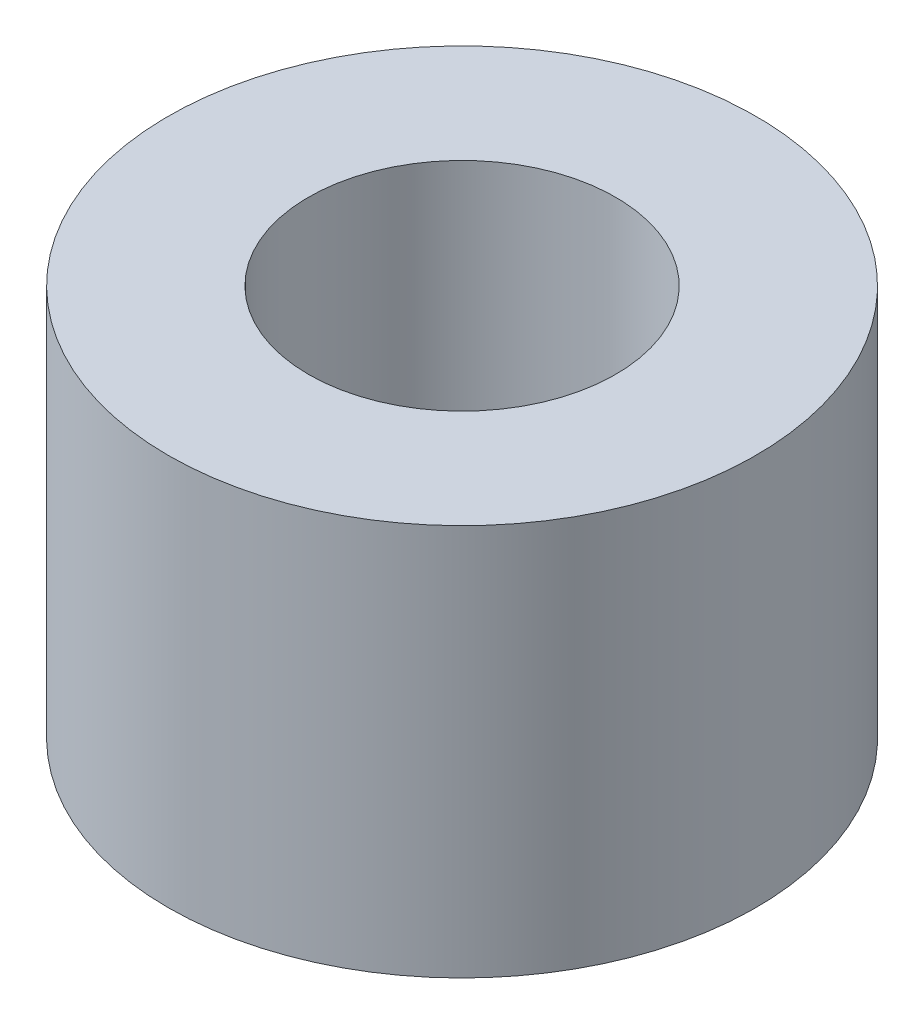
ISO-10303-21;
HEADER;
FILE_DESCRIPTION(('STEP AP214'),'2;1');
FILE_NAME('part.step','',(''),(''),'','','');
FILE_SCHEMA(('AUTOMOTIVE_DESIGN { 1 0 10303 214 1 1 1 1 }'));
ENDSEC;
DATA;
#1=APPLICATION_CONTEXT('core data for automotive mechanical design processes');
#2=APPLICATION_PROTOCOL_DEFINITION('international standard','automotive_design',2000,#1);
#3=PRODUCT_CONTEXT('',#1,'mechanical');
#4=PRODUCT('Part','Part','',(#3));
#5=PRODUCT_RELATED_PRODUCT_CATEGORY('part','',(#4));
#6=PRODUCT_DEFINITION_FORMATION('','',#4);
#7=PRODUCT_DEFINITION_CONTEXT('part definition',#1,'design');
#8=PRODUCT_DEFINITION('design','',#6,#7);
#9=PRODUCT_DEFINITION_SHAPE('','',#8);
#10=(LENGTH_UNIT() NAMED_UNIT(*) SI_UNIT(.MILLI.,.METRE.));
#11=(NAMED_UNIT(*) PLANE_ANGLE_UNIT() SI_UNIT($,.RADIAN.));
#12=(NAMED_UNIT(*) SI_UNIT($,.STERADIAN.) SOLID_ANGLE_UNIT());
#13=UNCERTAINTY_MEASURE_WITH_UNIT(LENGTH_MEASURE(1.E-05),#10,'distance_accuracy_value','');
#14=(GEOMETRIC_REPRESENTATION_CONTEXT(3) GLOBAL_UNCERTAINTY_ASSIGNED_CONTEXT((#13)) GLOBAL_UNIT_ASSIGNED_CONTEXT((#10,
#11,#12)) REPRESENTATION_CONTEXT('',''));
#15=CARTESIAN_POINT('',(0.,0.,0.));
#16=DIRECTION('',(0.,0.,1.));
#17=DIRECTION('',(1.,0.,0.));
#18=AXIS2_PLACEMENT_3D('',#15,#16,#17);
#19=CARTESIAN_POINT('',(0.,6.35,0.));
#20=DIRECTION('',(0.,1.,0.));
#21=DIRECTION('',(0.,0.,1.));
#22=AXIS2_PLACEMENT_3D('',#19,#20,#21);
#23=PLANE('',#22);
#24=CARTESIAN_POINT('',(0.,6.35,0.));
#25=DIRECTION('',(0.,1.,0.));
#26=DIRECTION('',(0.,0.,1.));
#27=AXIS2_PLACEMENT_3D('',#24,#25,#26);
#28=CIRCLE('',#27,4.7625);
#29=CARTESIAN_POINT('',(0.,6.35,4.7625));
#30=VERTEX_POINT('',#29);
#31=EDGE_CURVE('E10',#30,#30,#28,.T.);
#32=ORIENTED_EDGE('',*,*,#31,.T.);
#33=EDGE_LOOP('',(#32));
#34=FACE_BOUND('',#33,.T.);
#35=CARTESIAN_POINT('',(0.,6.35,0.));
#36=DIRECTION('',(0.,1.,0.));
#37=DIRECTION('',(0.,0.,1.));
#38=AXIS2_PLACEMENT_3D('',#35,#36,#37);
#39=CIRCLE('',#38,2.4892);
#40=CARTESIAN_POINT('',(0.,6.35,2.4892));
#41=VERTEX_POINT('',#40);
#42=EDGE_CURVE('E44',#41,#41,#39,.T.);
#43=ORIENTED_EDGE('',*,*,#42,.F.);
#44=EDGE_LOOP('',(#43));
#45=FACE_BOUND('',#44,.T.);
#46=ADVANCED_FACE('F33',(#34,#45),#23,.T.);
#47=CARTESIAN_POINT('',(0.,0.,0.));
#48=DIRECTION('',(0.,1.,0.));
#49=DIRECTION('',(0.,0.,1.));
#50=AXIS2_PLACEMENT_3D('',#47,#48,#49);
#51=PLANE('',#50);
#52=CARTESIAN_POINT('',(0.,0.,0.));
#53=DIRECTION('',(0.,1.,0.));
#54=DIRECTION('',(0.,0.,1.));
#55=AXIS2_PLACEMENT_3D('',#52,#53,#54);
#56=CIRCLE('',#55,4.7625);
#57=CARTESIAN_POINT('',(0.,0.,4.7625));
#58=VERTEX_POINT('',#57);
#59=EDGE_CURVE('E37',#58,#58,#56,.T.);
#60=ORIENTED_EDGE('',*,*,#59,.F.);
#61=EDGE_LOOP('',(#60));
#62=FACE_BOUND('',#61,.T.);
#63=CARTESIAN_POINT('',(0.,0.,0.));
#64=DIRECTION('',(0.,1.,0.));
#65=DIRECTION('',(0.,0.,1.));
#66=AXIS2_PLACEMENT_3D('',#63,#64,#65);
#67=CIRCLE('',#66,2.4892);
#68=CARTESIAN_POINT('',(0.,0.,2.4892));
#69=VERTEX_POINT('',#68);
#70=EDGE_CURVE('E46',#69,#69,#67,.T.);
#71=ORIENTED_EDGE('',*,*,#70,.T.);
#72=EDGE_LOOP('',(#71));
#73=FACE_BOUND('',#72,.T.);
#74=ADVANCED_FACE('F56',(#62,#73),#51,.F.);
#75=CARTESIAN_POINT('',(0.,6.35,0.));
#76=DIRECTION('',(0.,-1.,0.));
#77=DIRECTION('',(0.,0.,-1.));
#78=AXIS2_PLACEMENT_3D('',#75,#76,#77);
#79=CYLINDRICAL_SURFACE('',#78,4.7625);
#80=ORIENTED_EDGE('',*,*,#31,.F.);
#81=EDGE_LOOP('',(#80));
#82=FACE_BOUND('',#81,.T.);
#83=ORIENTED_EDGE('',*,*,#59,.T.);
#84=EDGE_LOOP('',(#83));
#85=FACE_BOUND('',#84,.T.);
#86=ADVANCED_FACE('F35',(#82,#85),#79,.T.);
#87=CARTESIAN_POINT('',(0.,6.35,0.));
#88=DIRECTION('',(0.,-1.,0.));
#89=DIRECTION('',(0.,0.,-1.));
#90=AXIS2_PLACEMENT_3D('',#87,#88,#89);
#91=CYLINDRICAL_SURFACE('',#90,2.4892);
#92=ORIENTED_EDGE('',*,*,#42,.T.);
#93=EDGE_LOOP('',(#92));
#94=FACE_BOUND('',#93,.T.);
#95=ORIENTED_EDGE('',*,*,#70,.F.);
#96=EDGE_LOOP('',(#95));
#97=FACE_BOUND('',#96,.T.);
#98=ADVANCED_FACE('F52',(#94,#97),#91,.F.);
#99=CLOSED_SHELL('',(#46,#74,#86,#98));
#100=MANIFOLD_SOLID_BREP('B2',#99);
#101=ADVANCED_BREP_SHAPE_REPRESENTATION('',(#18,#100),#14);
#102=SHAPE_DEFINITION_REPRESENTATION(#9,#101);
ENDSEC;
END-ISO-10303-21;
